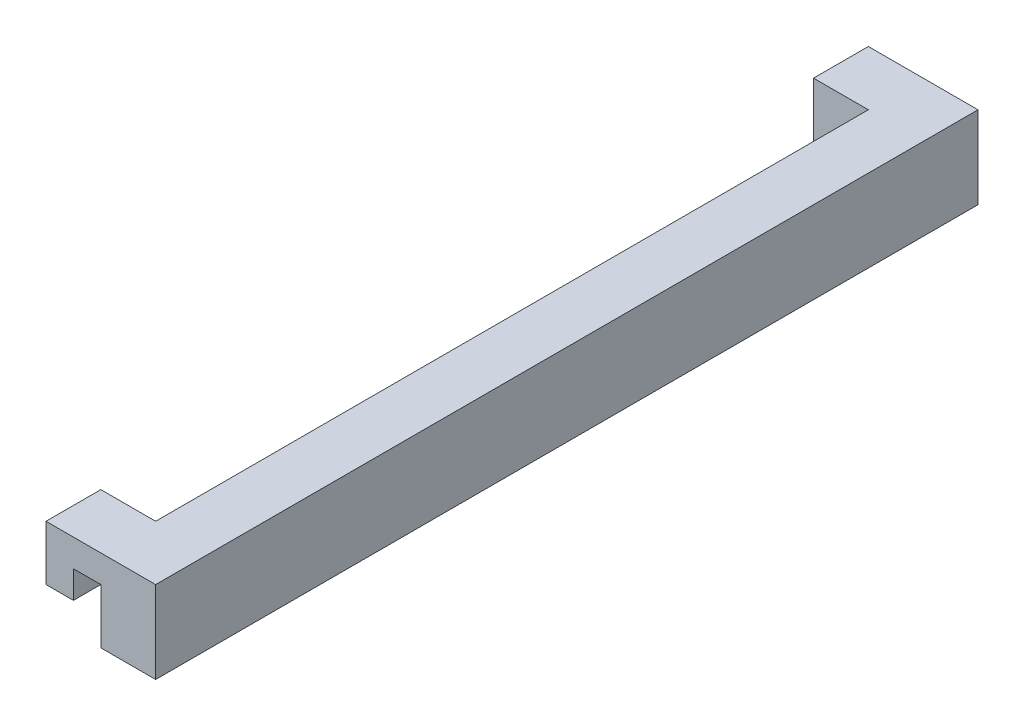
ISO-10303-21;
HEADER;
FILE_DESCRIPTION(('STEP AP214'),'2;1');
FILE_NAME('part.step','',(''),(''),'','','');
FILE_SCHEMA(('AUTOMOTIVE_DESIGN { 1 0 10303 214 1 1 1 1 }'));
ENDSEC;
DATA;
#1=APPLICATION_CONTEXT('core data for automotive mechanical design processes');
#2=APPLICATION_PROTOCOL_DEFINITION('international standard','automotive_design',2000,#1);
#3=PRODUCT_CONTEXT('',#1,'mechanical');
#4=PRODUCT('Part','Part','',(#3));
#5=PRODUCT_RELATED_PRODUCT_CATEGORY('part','',(#4));
#6=PRODUCT_DEFINITION_FORMATION('','',#4);
#7=PRODUCT_DEFINITION_CONTEXT('part definition',#1,'design');
#8=PRODUCT_DEFINITION('design','',#6,#7);
#9=PRODUCT_DEFINITION_SHAPE('','',#8);
#10=(LENGTH_UNIT() NAMED_UNIT(*) SI_UNIT(.MILLI.,.METRE.));
#11=(NAMED_UNIT(*) PLANE_ANGLE_UNIT() SI_UNIT($,.RADIAN.));
#12=(NAMED_UNIT(*) SI_UNIT($,.STERADIAN.) SOLID_ANGLE_UNIT());
#13=UNCERTAINTY_MEASURE_WITH_UNIT(LENGTH_MEASURE(1.E-05),#10,'distance_accuracy_value','');
#14=(GEOMETRIC_REPRESENTATION_CONTEXT(3) GLOBAL_UNCERTAINTY_ASSIGNED_CONTEXT((#13)) GLOBAL_UNIT_ASSIGNED_CONTEXT((#10,
#11,#12)) REPRESENTATION_CONTEXT('',''));
#15=CARTESIAN_POINT('',(0.,0.,0.));
#16=DIRECTION('',(0.,0.,1.));
#17=DIRECTION('',(1.,0.,0.));
#18=AXIS2_PLACEMENT_3D('',#15,#16,#17);
#19=CARTESIAN_POINT('',(20.,30.,0.));
#20=DIRECTION('',(0.,0.,-1.));
#21=DIRECTION('',(-1.,0.,0.));
#22=AXIS2_PLACEMENT_3D('',#19,#20,#21);
#23=PLANE('',#22);
#24=DIRECTION('',(0.,-1.,0.));
#25=VECTOR('',#24,1.);
#26=CARTESIAN_POINT('',(0.,30.,0.));
#27=LINE('',#26,#25);
#28=CARTESIAN_POINT('',(0.,30.,0.));
#29=VERTEX_POINT('',#28);
#30=CARTESIAN_POINT('',(0.,10.,0.));
#31=VERTEX_POINT('',#30);
#32=EDGE_CURVE('E127',#29,#31,#27,.T.);
#33=ORIENTED_EDGE('',*,*,#32,.T.);
#34=DIRECTION('',(1.,0.,0.));
#35=VECTOR('',#34,1.);
#36=CARTESIAN_POINT('',(20.,10.,0.));
#37=LINE('',#36,#35);
#38=CARTESIAN_POINT('',(10.,10.,0.));
#39=VERTEX_POINT('',#38);
#40=EDGE_CURVE('E208',#31,#39,#37,.T.);
#41=ORIENTED_EDGE('',*,*,#40,.T.);
#42=DIRECTION('',(0.,1.,0.));
#43=VECTOR('',#42,1.);
#44=CARTESIAN_POINT('',(10.,30.,0.));
#45=LINE('',#44,#43);
#46=CARTESIAN_POINT('',(10.,20.,0.));
#47=VERTEX_POINT('',#46);
#48=EDGE_CURVE('E134',#39,#47,#45,.T.);
#49=ORIENTED_EDGE('',*,*,#48,.T.);
#50=DIRECTION('',(1.,0.,0.));
#51=VECTOR('',#50,1.);
#52=CARTESIAN_POINT('',(20.,20.,0.));
#53=LINE('',#52,#51);
#54=CARTESIAN_POINT('',(20.,20.,0.));
#55=VERTEX_POINT('',#54);
#56=EDGE_CURVE('E217',#47,#55,#53,.T.);
#57=ORIENTED_EDGE('',*,*,#56,.T.);
#58=DIRECTION('',(0.,-1.,0.));
#59=VECTOR('',#58,1.);
#60=CARTESIAN_POINT('',(20.,30.,0.));
#61=LINE('',#60,#59);
#62=CARTESIAN_POINT('',(20.,30.,0.));
#63=VERTEX_POINT('',#62);
#64=EDGE_CURVE('E11',#63,#55,#61,.T.);
#65=ORIENTED_EDGE('',*,*,#64,.F.);
#66=DIRECTION('',(1.,0.,0.));
#67=VECTOR('',#66,1.);
#68=CARTESIAN_POINT('',(20.,30.,0.));
#69=LINE('',#68,#67);
#70=EDGE_CURVE('E142',#29,#63,#69,.T.);
#71=ORIENTED_EDGE('',*,*,#70,.F.);
#72=EDGE_LOOP('',(#33,#41,#49,#57,#65,#71));
#73=FACE_BOUND('',#72,.T.);
#74=ADVANCED_FACE('F39',(#73),#23,.F.);
#75=CARTESIAN_POINT('',(20.,30.,260.));
#76=DIRECTION('',(1.,0.,0.));
#77=DIRECTION('',(0.,0.,-1.));
#78=AXIS2_PLACEMENT_3D('',#75,#76,#77);
#79=PLANE('',#78);
#80=ORIENTED_EDGE('',*,*,#64,.T.);
#81=DIRECTION('',(0.,0.,1.));
#82=VECTOR('',#81,1.);
#83=CARTESIAN_POINT('',(20.,20.,-20.));
#84=LINE('',#83,#82);
#85=CARTESIAN_POINT('',(20.,20.,-20.));
#86=VERTEX_POINT('',#85);
#87=EDGE_CURVE('E184',#86,#55,#84,.T.);
#88=ORIENTED_EDGE('',*,*,#87,.F.);
#89=DIRECTION('',(0.,1.,0.));
#90=VECTOR('',#89,1.);
#91=CARTESIAN_POINT('',(20.,20.,-20.));
#92=LINE('',#91,#90);
#93=CARTESIAN_POINT('',(20.,0.,-20.));
#94=VERTEX_POINT('',#93);
#95=EDGE_CURVE('E320',#94,#86,#92,.T.);
#96=ORIENTED_EDGE('',*,*,#95,.F.);
#97=DIRECTION('',(0.,0.,1.));
#98=VECTOR('',#97,1.);
#99=CARTESIAN_POINT('',(20.,0.,260.));
#100=LINE('',#99,#98);
#101=CARTESIAN_POINT('',(20.,0.,280.));
#102=VERTEX_POINT('',#101);
#103=EDGE_CURVE('E54',#94,#102,#100,.T.);
#104=ORIENTED_EDGE('',*,*,#103,.T.);
#105=DIRECTION('',(0.,-1.,0.));
#106=VECTOR('',#105,1.);
#107=CARTESIAN_POINT('',(20.,30.,280.));
#108=LINE('',#107,#106);
#109=CARTESIAN_POINT('',(20.,20.,280.));
#110=VERTEX_POINT('',#109);
#111=EDGE_CURVE('E179',#110,#102,#108,.T.);
#112=ORIENTED_EDGE('',*,*,#111,.F.);
#113=CARTESIAN_POINT('',(20.,20.,260.));
#114=VERTEX_POINT('',#113);
#115=EDGE_CURVE('E177',#114,#110,#84,.T.);
#116=ORIENTED_EDGE('',*,*,#115,.F.);
#117=DIRECTION('',(0.,-1.,0.));
#118=VECTOR('',#117,1.);
#119=CARTESIAN_POINT('',(20.,30.,260.));
#120=LINE('',#119,#118);
#121=CARTESIAN_POINT('',(20.,30.,260.));
#122=VERTEX_POINT('',#121);
#123=EDGE_CURVE('E47',#122,#114,#120,.T.);
#124=ORIENTED_EDGE('',*,*,#123,.F.);
#125=DIRECTION('',(0.,0.,1.));
#126=VECTOR('',#125,1.);
#127=CARTESIAN_POINT('',(20.,30.,260.));
#128=LINE('',#127,#126);
#129=EDGE_CURVE('E87',#63,#122,#128,.T.);
#130=ORIENTED_EDGE('',*,*,#129,.F.);
#131=EDGE_LOOP('',(#80,#88,#96,#104,#112,#116,#124,#130));
#132=FACE_BOUND('',#131,.T.);
#133=ADVANCED_FACE('F174',(#132),#79,.F.);
#134=CARTESIAN_POINT('',(0.,30.,260.));
#135=DIRECTION('',(0.,0.,1.));
#136=DIRECTION('',(1.,0.,0.));
#137=AXIS2_PLACEMENT_3D('',#134,#135,#136);
#138=PLANE('',#137);
#139=DIRECTION('',(0.,-1.,0.));
#140=VECTOR('',#139,1.);
#141=CARTESIAN_POINT('',(10.,30.,260.));
#142=LINE('',#141,#140);
#143=CARTESIAN_POINT('',(10.,20.,260.));
#144=VERTEX_POINT('',#143);
#145=CARTESIAN_POINT('',(10.,10.,260.));
#146=VERTEX_POINT('',#145);
#147=EDGE_CURVE('E225',#144,#146,#142,.T.);
#148=ORIENTED_EDGE('',*,*,#147,.T.);
#149=DIRECTION('',(-1.,0.,0.));
#150=VECTOR('',#149,1.);
#151=CARTESIAN_POINT('',(0.,10.,260.));
#152=LINE('',#151,#150);
#153=CARTESIAN_POINT('',(0.,10.,260.));
#154=VERTEX_POINT('',#153);
#155=EDGE_CURVE('E204',#146,#154,#152,.T.);
#156=ORIENTED_EDGE('',*,*,#155,.T.);
#157=DIRECTION('',(0.,-1.,0.));
#158=VECTOR('',#157,1.);
#159=CARTESIAN_POINT('',(0.,30.,260.));
#160=LINE('',#159,#158);
#161=CARTESIAN_POINT('',(0.,30.,260.));
#162=VERTEX_POINT('',#161);
#163=EDGE_CURVE('E154',#162,#154,#160,.T.);
#164=ORIENTED_EDGE('',*,*,#163,.F.);
#165=DIRECTION('',(-1.,0.,0.));
#166=VECTOR('',#165,1.);
#167=CARTESIAN_POINT('',(0.,30.,260.));
#168=LINE('',#167,#166);
#169=EDGE_CURVE('E169',#122,#162,#168,.T.);
#170=ORIENTED_EDGE('',*,*,#169,.F.);
#171=ORIENTED_EDGE('',*,*,#123,.T.);
#172=DIRECTION('',(-1.,0.,0.));
#173=VECTOR('',#172,1.);
#174=CARTESIAN_POINT('',(0.,20.,260.));
#175=LINE('',#174,#173);
#176=EDGE_CURVE('E167',#114,#144,#175,.T.);
#177=ORIENTED_EDGE('',*,*,#176,.T.);
#178=EDGE_LOOP('',(#148,#156,#164,#170,#171,#177));
#179=FACE_BOUND('',#178,.T.);
#180=ADVANCED_FACE('F164',(#179),#138,.F.);
#181=CARTESIAN_POINT('',(0.,30.,280.));
#182=DIRECTION('',(1.,0.,0.));
#183=DIRECTION('',(0.,0.,-1.));
#184=AXIS2_PLACEMENT_3D('',#181,#182,#183);
#185=PLANE('',#184);
#186=ORIENTED_EDGE('',*,*,#163,.T.);
#187=DIRECTION('',(0.,0.,1.));
#188=VECTOR('',#187,1.);
#189=CARTESIAN_POINT('',(0.,10.,-20.));
#190=LINE('',#189,#188);
#191=CARTESIAN_POINT('',(0.,10.,280.));
#192=VERTEX_POINT('',#191);
#193=EDGE_CURVE('E243',#154,#192,#190,.T.);
#194=ORIENTED_EDGE('',*,*,#193,.T.);
#195=DIRECTION('',(0.,-1.,0.));
#196=VECTOR('',#195,1.);
#197=CARTESIAN_POINT('',(0.,30.,280.));
#198=LINE('',#197,#196);
#199=CARTESIAN_POINT('',(0.,30.,280.));
#200=VERTEX_POINT('',#199);
#201=EDGE_CURVE('E150',#200,#192,#198,.T.);
#202=ORIENTED_EDGE('',*,*,#201,.F.);
#203=DIRECTION('',(0.,0.,1.));
#204=VECTOR('',#203,1.);
#205=CARTESIAN_POINT('',(0.,30.,280.));
#206=LINE('',#205,#204);
#207=EDGE_CURVE('E237',#162,#200,#206,.T.);
#208=ORIENTED_EDGE('',*,*,#207,.F.);
#209=EDGE_LOOP('',(#186,#194,#202,#208));
#210=FACE_BOUND('',#209,.T.);
#211=ADVANCED_FACE('F279',(#210),#185,.F.);
#212=CARTESIAN_POINT('',(40.,30.,280.));
#213=DIRECTION('',(0.,0.,-1.));
#214=DIRECTION('',(-1.,0.,0.));
#215=AXIS2_PLACEMENT_3D('',#212,#213,#214);
#216=PLANE('',#215);
#217=ORIENTED_EDGE('',*,*,#201,.T.);
#218=DIRECTION('',(1.,0.,0.));
#219=VECTOR('',#218,1.);
#220=CARTESIAN_POINT('',(40.,10.,280.));
#221=LINE('',#220,#219);
#222=CARTESIAN_POINT('',(10.,10.,280.));
#223=VERTEX_POINT('',#222);
#224=EDGE_CURVE('E199',#192,#223,#221,.T.);
#225=ORIENTED_EDGE('',*,*,#224,.T.);
#226=DIRECTION('',(0.,1.,0.));
#227=VECTOR('',#226,1.);
#228=CARTESIAN_POINT('',(10.,30.,280.));
#229=LINE('',#228,#227);
#230=CARTESIAN_POINT('',(10.,20.,280.));
#231=VERTEX_POINT('',#230);
#232=EDGE_CURVE('E221',#223,#231,#229,.T.);
#233=ORIENTED_EDGE('',*,*,#232,.T.);
#234=DIRECTION('',(1.,0.,0.));
#235=VECTOR('',#234,1.);
#236=CARTESIAN_POINT('',(40.,20.,280.));
#237=LINE('',#236,#235);
#238=EDGE_CURVE('E212',#231,#110,#237,.T.);
#239=ORIENTED_EDGE('',*,*,#238,.T.);
#240=ORIENTED_EDGE('',*,*,#111,.T.);
#241=DIRECTION('',(1.,0.,0.));
#242=VECTOR('',#241,1.);
#243=CARTESIAN_POINT('',(40.,0.,280.));
#244=LINE('',#243,#242);
#245=CARTESIAN_POINT('',(40.,0.,280.));
#246=VERTEX_POINT('',#245);
#247=EDGE_CURVE('E133',#102,#246,#244,.T.);
#248=ORIENTED_EDGE('',*,*,#247,.T.);
#249=DIRECTION('',(0.,-1.,0.));
#250=VECTOR('',#249,1.);
#251=CARTESIAN_POINT('',(40.,30.,280.));
#252=LINE('',#251,#250);
#253=CARTESIAN_POINT('',(40.,30.,280.));
#254=VERTEX_POINT('',#253);
#255=EDGE_CURVE('E117',#254,#246,#252,.T.);
#256=ORIENTED_EDGE('',*,*,#255,.F.);
#257=DIRECTION('',(1.,0.,0.));
#258=VECTOR('',#257,1.);
#259=CARTESIAN_POINT('',(40.,30.,280.));
#260=LINE('',#259,#258);
#261=EDGE_CURVE('E108',#200,#254,#260,.T.);
#262=ORIENTED_EDGE('',*,*,#261,.F.);
#263=EDGE_LOOP('',(#217,#225,#233,#239,#240,#248,#256,#262));
#264=FACE_BOUND('',#263,.T.);
#265=ADVANCED_FACE('F264',(#264),#216,.F.);
#266=CARTESIAN_POINT('',(40.,30.,-20.));
#267=DIRECTION('',(-1.,0.,0.));
#268=DIRECTION('',(0.,0.,1.));
#269=AXIS2_PLACEMENT_3D('',#266,#267,#268);
#270=PLANE('',#269);
#271=DIRECTION('',(0.,0.,-1.));
#272=VECTOR('',#271,1.);
#273=CARTESIAN_POINT('',(40.,0.,-20.));
#274=LINE('',#273,#272);
#275=CARTESIAN_POINT('',(40.,0.,-20.));
#276=VERTEX_POINT('',#275);
#277=EDGE_CURVE('E79',#246,#276,#274,.T.);
#278=ORIENTED_EDGE('',*,*,#277,.T.);
#279=DIRECTION('',(0.,-1.,0.));
#280=VECTOR('',#279,1.);
#281=CARTESIAN_POINT('',(40.,30.,-20.));
#282=LINE('',#281,#280);
#283=CARTESIAN_POINT('',(40.,30.,-20.));
#284=VERTEX_POINT('',#283);
#285=EDGE_CURVE('E112',#284,#276,#282,.T.);
#286=ORIENTED_EDGE('',*,*,#285,.F.);
#287=DIRECTION('',(0.,0.,-1.));
#288=VECTOR('',#287,1.);
#289=CARTESIAN_POINT('',(40.,30.,-20.));
#290=LINE('',#289,#288);
#291=EDGE_CURVE('E102',#254,#284,#290,.T.);
#292=ORIENTED_EDGE('',*,*,#291,.F.);
#293=ORIENTED_EDGE('',*,*,#255,.T.);
#294=EDGE_LOOP('',(#278,#286,#292,#293));
#295=FACE_BOUND('',#294,.T.);
#296=ADVANCED_FACE('F113',(#295),#270,.F.);
#297=CARTESIAN_POINT('',(0.,30.,-20.));
#298=DIRECTION('',(0.,0.,1.));
#299=DIRECTION('',(1.,0.,0.));
#300=AXIS2_PLACEMENT_3D('',#297,#298,#299);
#301=PLANE('',#300);
#302=DIRECTION('',(0.,-1.,0.));
#303=VECTOR('',#302,1.);
#304=CARTESIAN_POINT('',(10.,10.,-20.));
#305=LINE('',#304,#303);
#306=CARTESIAN_POINT('',(10.,20.,-20.));
#307=VERTEX_POINT('',#306);
#308=CARTESIAN_POINT('',(10.,10.,-20.));
#309=VERTEX_POINT('',#308);
#310=EDGE_CURVE('E191',#307,#309,#305,.T.);
#311=ORIENTED_EDGE('',*,*,#310,.T.);
#312=DIRECTION('',(-1.,0.,0.));
#313=VECTOR('',#312,1.);
#314=CARTESIAN_POINT('',(0.,10.,-20.));
#315=LINE('',#314,#313);
#316=CARTESIAN_POINT('',(0.,10.,-20.));
#317=VERTEX_POINT('',#316);
#318=EDGE_CURVE('E185',#309,#317,#315,.T.);
#319=ORIENTED_EDGE('',*,*,#318,.T.);
#320=DIRECTION('',(0.,-1.,0.));
#321=VECTOR('',#320,1.);
#322=CARTESIAN_POINT('',(0.,30.,-20.));
#323=LINE('',#322,#321);
#324=CARTESIAN_POINT('',(0.,30.,-20.));
#325=VERTEX_POINT('',#324);
#326=EDGE_CURVE('E118',#325,#317,#323,.T.);
#327=ORIENTED_EDGE('',*,*,#326,.F.);
#328=DIRECTION('',(-1.,0.,0.));
#329=VECTOR('',#328,1.);
#330=CARTESIAN_POINT('',(0.,30.,-20.));
#331=LINE('',#330,#329);
#332=EDGE_CURVE('E105',#284,#325,#331,.T.);
#333=ORIENTED_EDGE('',*,*,#332,.F.);
#334=ORIENTED_EDGE('',*,*,#285,.T.);
#335=DIRECTION('',(-1.,0.,0.));
#336=VECTOR('',#335,1.);
#337=CARTESIAN_POINT('',(0.,0.,-20.));
#338=LINE('',#337,#336);
#339=EDGE_CURVE('E139',#276,#94,#338,.T.);
#340=ORIENTED_EDGE('',*,*,#339,.T.);
#341=ORIENTED_EDGE('',*,*,#95,.T.);
#342=DIRECTION('',(-1.,0.,0.));
#343=VECTOR('',#342,1.);
#344=CARTESIAN_POINT('',(10.,20.,-20.));
#345=LINE('',#344,#343);
#346=EDGE_CURVE('E323',#86,#307,#345,.T.);
#347=ORIENTED_EDGE('',*,*,#346,.T.);
#348=EDGE_LOOP('',(#311,#319,#327,#333,#334,#340,#341,#347));
#349=FACE_BOUND('',#348,.T.);
#350=ADVANCED_FACE('F121',(#349),#301,.F.);
#351=CARTESIAN_POINT('',(0.,30.,0.));
#352=DIRECTION('',(1.,0.,0.));
#353=DIRECTION('',(0.,0.,-1.));
#354=AXIS2_PLACEMENT_3D('',#351,#352,#353);
#355=PLANE('',#354);
#356=ORIENTED_EDGE('',*,*,#326,.T.);
#357=EDGE_CURVE('E200',#317,#31,#190,.T.);
#358=ORIENTED_EDGE('',*,*,#357,.T.);
#359=ORIENTED_EDGE('',*,*,#32,.F.);
#360=DIRECTION('',(0.,0.,1.));
#361=VECTOR('',#360,1.);
#362=CARTESIAN_POINT('',(0.,30.,0.));
#363=LINE('',#362,#361);
#364=EDGE_CURVE('E63',#325,#29,#363,.T.);
#365=ORIENTED_EDGE('',*,*,#364,.F.);
#366=EDGE_LOOP('',(#356,#358,#359,#365));
#367=FACE_BOUND('',#366,.T.);
#368=ADVANCED_FACE('F311',(#367),#355,.F.);
#369=CARTESIAN_POINT('',(0.,30.,0.));
#370=DIRECTION('',(0.,-1.,0.));
#371=DIRECTION('',(0.,0.,-1.));
#372=AXIS2_PLACEMENT_3D('',#369,#370,#371);
#373=PLANE('',#372);
#374=ORIENTED_EDGE('',*,*,#70,.T.);
#375=ORIENTED_EDGE('',*,*,#129,.T.);
#376=ORIENTED_EDGE('',*,*,#169,.T.);
#377=ORIENTED_EDGE('',*,*,#207,.T.);
#378=ORIENTED_EDGE('',*,*,#261,.T.);
#379=ORIENTED_EDGE('',*,*,#291,.T.);
#380=ORIENTED_EDGE('',*,*,#332,.T.);
#381=ORIENTED_EDGE('',*,*,#364,.T.);
#382=EDGE_LOOP('',(#374,#375,#376,#377,#378,#379,#380,#381));
#383=FACE_BOUND('',#382,.T.);
#384=ADVANCED_FACE('F103',(#383),#373,.F.);
#385=CARTESIAN_POINT('',(0.,0.,0.));
#386=DIRECTION('',(0.,-1.,0.));
#387=DIRECTION('',(0.,0.,-1.));
#388=AXIS2_PLACEMENT_3D('',#385,#386,#387);
#389=PLANE('',#388);
#390=ORIENTED_EDGE('',*,*,#103,.F.);
#391=ORIENTED_EDGE('',*,*,#339,.F.);
#392=ORIENTED_EDGE('',*,*,#277,.F.);
#393=ORIENTED_EDGE('',*,*,#247,.F.);
#394=EDGE_LOOP('',(#390,#391,#392,#393));
#395=FACE_BOUND('',#394,.T.);
#396=ADVANCED_FACE('F321',(#395),#389,.T.);
#397=CARTESIAN_POINT('',(10.,20.,-20.));
#398=DIRECTION('',(0.,1.,0.));
#399=DIRECTION('',(0.,0.,1.));
#400=AXIS2_PLACEMENT_3D('',#397,#398,#399);
#401=PLANE('',#400);
#402=ORIENTED_EDGE('',*,*,#115,.T.);
#403=ORIENTED_EDGE('',*,*,#238,.F.);
#404=DIRECTION('',(0.,0.,1.));
#405=VECTOR('',#404,1.);
#406=CARTESIAN_POINT('',(10.,20.,-20.));
#407=LINE('',#406,#405);
#408=EDGE_CURVE('E190',#144,#231,#407,.T.);
#409=ORIENTED_EDGE('',*,*,#408,.F.);
#410=ORIENTED_EDGE('',*,*,#176,.F.);
#411=EDGE_LOOP('',(#402,#403,#409,#410));
#412=FACE_BOUND('',#411,.T.);
#413=ADVANCED_FACE('F332',(#412),#401,.F.);
#414=CARTESIAN_POINT('',(10.,10.,-20.));
#415=DIRECTION('',(-1.,0.,0.));
#416=DIRECTION('',(0.,0.,1.));
#417=AXIS2_PLACEMENT_3D('',#414,#415,#416);
#418=PLANE('',#417);
#419=ORIENTED_EDGE('',*,*,#408,.T.);
#420=ORIENTED_EDGE('',*,*,#232,.F.);
#421=DIRECTION('',(0.,0.,1.));
#422=VECTOR('',#421,1.);
#423=CARTESIAN_POINT('',(10.,10.,-20.));
#424=LINE('',#423,#422);
#425=EDGE_CURVE('E250',#146,#223,#424,.T.);
#426=ORIENTED_EDGE('',*,*,#425,.F.);
#427=ORIENTED_EDGE('',*,*,#147,.F.);
#428=EDGE_LOOP('',(#419,#420,#426,#427));
#429=FACE_BOUND('',#428,.T.);
#430=ADVANCED_FACE('F260',(#429),#418,.F.);
#431=CARTESIAN_POINT('',(0.,10.,-20.));
#432=DIRECTION('',(0.,1.,0.));
#433=DIRECTION('',(0.,0.,1.));
#434=AXIS2_PLACEMENT_3D('',#431,#432,#433);
#435=PLANE('',#434);
#436=ORIENTED_EDGE('',*,*,#425,.T.);
#437=ORIENTED_EDGE('',*,*,#224,.F.);
#438=ORIENTED_EDGE('',*,*,#193,.F.);
#439=ORIENTED_EDGE('',*,*,#155,.F.);
#440=EDGE_LOOP('',(#436,#437,#438,#439));
#441=FACE_BOUND('',#440,.T.);
#442=ADVANCED_FACE('F273',(#441),#435,.F.);
#443=EDGE_CURVE('E247',#309,#39,#424,.T.);
#444=ORIENTED_EDGE('',*,*,#443,.F.);
#445=ORIENTED_EDGE('',*,*,#310,.F.);
#446=EDGE_CURVE('E195',#307,#47,#407,.T.);
#447=ORIENTED_EDGE('',*,*,#446,.T.);
#448=ORIENTED_EDGE('',*,*,#48,.F.);
#449=EDGE_LOOP('',(#444,#445,#447,#448));
#450=FACE_BOUND('',#449,.T.);
#451=ADVANCED_FACE('F299',(#450),#418,.F.);
#452=ORIENTED_EDGE('',*,*,#446,.F.);
#453=ORIENTED_EDGE('',*,*,#346,.F.);
#454=ORIENTED_EDGE('',*,*,#87,.T.);
#455=ORIENTED_EDGE('',*,*,#56,.F.);
#456=EDGE_LOOP('',(#452,#453,#454,#455));
#457=FACE_BOUND('',#456,.T.);
#458=ADVANCED_FACE('F290',(#457),#401,.F.);
#459=ORIENTED_EDGE('',*,*,#357,.F.);
#460=ORIENTED_EDGE('',*,*,#318,.F.);
#461=ORIENTED_EDGE('',*,*,#443,.T.);
#462=ORIENTED_EDGE('',*,*,#40,.F.);
#463=EDGE_LOOP('',(#459,#460,#461,#462));
#464=FACE_BOUND('',#463,.T.);
#465=ADVANCED_FACE('F305',(#464),#435,.F.);
#466=CLOSED_SHELL('',(#74,#133,#180,#211,#265,#296,#350,#368,#384,#396,#413,#430,#442,#451,#458,#465));
#467=MANIFOLD_SOLID_BREP('B2',#466);
#468=ADVANCED_BREP_SHAPE_REPRESENTATION('',(#18,#467),#14);
#469=SHAPE_DEFINITION_REPRESENTATION(#9,#468);
ENDSEC;
END-ISO-10303-21;
